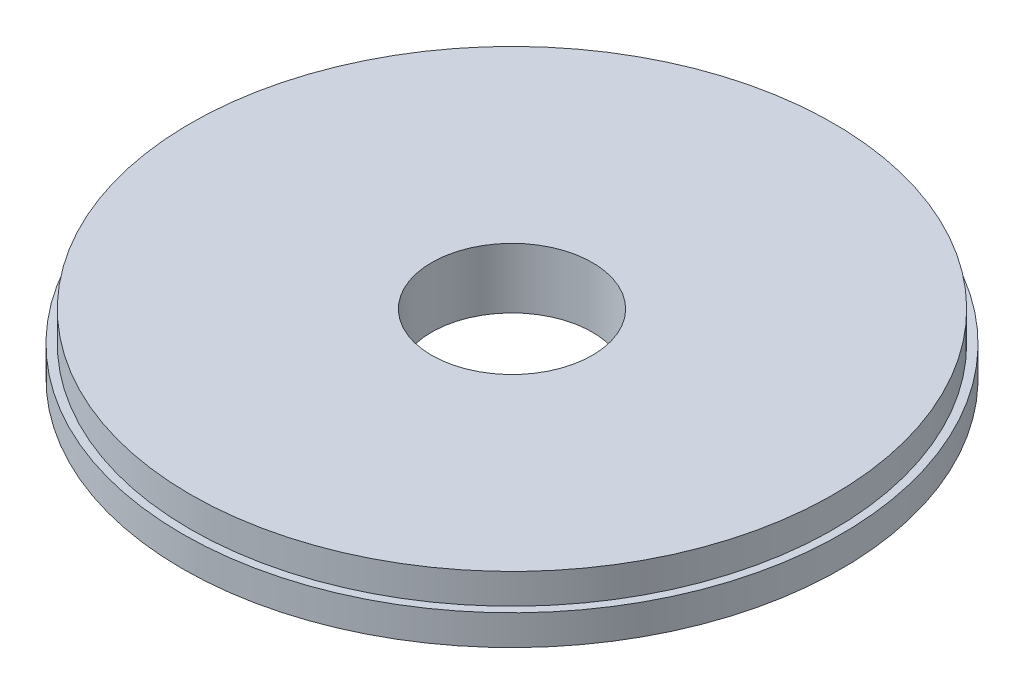
ISO-10303-21;
HEADER;
FILE_DESCRIPTION(('STEP AP214'),'2;1');
FILE_NAME('part.step','',(''),(''),'','','');
FILE_SCHEMA(('AUTOMOTIVE_DESIGN { 1 0 10303 214 1 1 1 1 }'));
ENDSEC;
DATA;
#1=APPLICATION_CONTEXT('core data for automotive mechanical design processes');
#2=APPLICATION_PROTOCOL_DEFINITION('international standard','automotive_design',2000,#1);
#3=PRODUCT_CONTEXT('',#1,'mechanical');
#4=PRODUCT('Part','Part','',(#3));
#5=PRODUCT_RELATED_PRODUCT_CATEGORY('part','',(#4));
#6=PRODUCT_DEFINITION_FORMATION('','',#4);
#7=PRODUCT_DEFINITION_CONTEXT('part definition',#1,'design');
#8=PRODUCT_DEFINITION('design','',#6,#7);
#9=PRODUCT_DEFINITION_SHAPE('','',#8);
#10=(LENGTH_UNIT() NAMED_UNIT(*) SI_UNIT(.MILLI.,.METRE.));
#11=(NAMED_UNIT(*) PLANE_ANGLE_UNIT() SI_UNIT($,.RADIAN.));
#12=(NAMED_UNIT(*) SI_UNIT($,.STERADIAN.) SOLID_ANGLE_UNIT());
#13=UNCERTAINTY_MEASURE_WITH_UNIT(LENGTH_MEASURE(1.E-05),#10,'distance_accuracy_value','');
#14=(GEOMETRIC_REPRESENTATION_CONTEXT(3) GLOBAL_UNCERTAINTY_ASSIGNED_CONTEXT((#13)) GLOBAL_UNIT_ASSIGNED_CONTEXT((#10,
#11,#12)) REPRESENTATION_CONTEXT('',''));
#15=CARTESIAN_POINT('',(0.,0.,0.));
#16=DIRECTION('',(0.,0.,1.));
#17=DIRECTION('',(1.,0.,0.));
#18=AXIS2_PLACEMENT_3D('',#15,#16,#17);
#19=CARTESIAN_POINT('',(0.,9.525,0.));
#20=DIRECTION('',(0.,1.,0.));
#21=DIRECTION('',(0.,0.,1.));
#22=AXIS2_PLACEMENT_3D('',#19,#20,#21);
#23=PLANE('',#22);
#24=CARTESIAN_POINT('',(0.,9.525,0.));
#25=DIRECTION('',(0.,1.,0.));
#26=DIRECTION('',(0.,0.,1.));
#27=AXIS2_PLACEMENT_3D('',#24,#25,#26);
#28=CIRCLE('',#27,101.6);
#29=CARTESIAN_POINT('',(0.,9.525,101.6));
#30=VERTEX_POINT('',#29);
#31=EDGE_CURVE('E10',#30,#30,#28,.T.);
#32=ORIENTED_EDGE('',*,*,#31,.T.);
#33=EDGE_LOOP('',(#32));
#34=FACE_BOUND('',#33,.T.);
#35=CARTESIAN_POINT('',(0.,9.525,0.));
#36=DIRECTION('',(0.,1.,0.));
#37=DIRECTION('',(0.,0.,1.));
#38=AXIS2_PLACEMENT_3D('',#35,#36,#37);
#39=CIRCLE('',#38,25.4);
#40=CARTESIAN_POINT('',(0.,9.525,25.4));
#41=VERTEX_POINT('',#40);
#42=EDGE_CURVE('E39',#41,#41,#39,.T.);
#43=ORIENTED_EDGE('',*,*,#42,.F.);
#44=EDGE_LOOP('',(#43));
#45=FACE_BOUND('',#44,.T.);
#46=ADVANCED_FACE('F32',(#34,#45),#23,.T.);
#47=CARTESIAN_POINT('',(0.,-9.525,0.));
#48=DIRECTION('',(0.,1.,0.));
#49=DIRECTION('',(0.,0.,1.));
#50=AXIS2_PLACEMENT_3D('',#47,#48,#49);
#51=PLANE('',#50);
#52=CARTESIAN_POINT('',(0.,-9.525,0.));
#53=DIRECTION('',(0.,1.,0.));
#54=DIRECTION('',(0.,0.,1.));
#55=AXIS2_PLACEMENT_3D('',#52,#53,#54);
#56=CIRCLE('',#55,25.4);
#57=CARTESIAN_POINT('',(0.,-9.525,25.4));
#58=VERTEX_POINT('',#57);
#59=EDGE_CURVE('E43',#58,#58,#56,.T.);
#60=ORIENTED_EDGE('',*,*,#59,.T.);
#61=EDGE_LOOP('',(#60));
#62=FACE_BOUND('',#61,.T.);
#63=CARTESIAN_POINT('',(0.,-9.525,0.));
#64=DIRECTION('',(0.,1.,0.));
#65=DIRECTION('',(0.,0.,1.));
#66=AXIS2_PLACEMENT_3D('',#63,#64,#65);
#67=CIRCLE('',#66,104.14);
#68=CARTESIAN_POINT('',(0.,-9.525,104.14));
#69=VERTEX_POINT('',#68);
#70=EDGE_CURVE('E53',#69,#69,#67,.T.);
#71=ORIENTED_EDGE('',*,*,#70,.F.);
#72=EDGE_LOOP('',(#71));
#73=FACE_BOUND('',#72,.T.);
#74=ADVANCED_FACE('F74',(#62,#73),#51,.F.);
#75=CARTESIAN_POINT('',(0.,9.525,0.));
#76=DIRECTION('',(0.,-1.,0.));
#77=DIRECTION('',(0.,0.,-1.));
#78=AXIS2_PLACEMENT_3D('',#75,#76,#77);
#79=CYLINDRICAL_SURFACE('',#78,101.6);
#80=CARTESIAN_POINT('',(0.,0.,0.));
#81=DIRECTION('',(0.,1.,0.));
#82=DIRECTION('',(0.,0.,1.));
#83=AXIS2_PLACEMENT_3D('',#80,#81,#82);
#84=CIRCLE('',#83,101.6);
#85=CARTESIAN_POINT('',(0.,0.,101.6));
#86=VERTEX_POINT('',#85);
#87=EDGE_CURVE('E50',#86,#86,#84,.T.);
#88=ORIENTED_EDGE('',*,*,#87,.T.);
#89=EDGE_LOOP('',(#88));
#90=FACE_BOUND('',#89,.T.);
#91=ORIENTED_EDGE('',*,*,#31,.F.);
#92=EDGE_LOOP('',(#91));
#93=FACE_BOUND('',#92,.T.);
#94=ADVANCED_FACE('F34',(#90,#93),#79,.T.);
#95=CARTESIAN_POINT('',(0.,9.525,0.));
#96=DIRECTION('',(0.,-1.,0.));
#97=DIRECTION('',(0.,0.,-1.));
#98=AXIS2_PLACEMENT_3D('',#95,#96,#97);
#99=CYLINDRICAL_SURFACE('',#98,25.4);
#100=ORIENTED_EDGE('',*,*,#42,.T.);
#101=EDGE_LOOP('',(#100));
#102=FACE_BOUND('',#101,.T.);
#103=ORIENTED_EDGE('',*,*,#59,.F.);
#104=EDGE_LOOP('',(#103));
#105=FACE_BOUND('',#104,.T.);
#106=ADVANCED_FACE('F63',(#102,#105),#99,.F.);
#107=CARTESIAN_POINT('',(0.,294.552400771068,0.));
#108=DIRECTION('',(0.,-1.,0.));
#109=DIRECTION('',(0.,0.,-1.));
#110=AXIS2_PLACEMENT_3D('',#107,#108,#109);
#111=CYLINDRICAL_SURFACE('',#110,104.14);
#112=ORIENTED_EDGE('',*,*,#70,.T.);
#113=EDGE_LOOP('',(#112));
#114=FACE_BOUND('',#113,.T.);
#115=CARTESIAN_POINT('',(0.,0.,0.));
#116=DIRECTION('',(0.,1.,0.));
#117=DIRECTION('',(0.,0.,1.));
#118=AXIS2_PLACEMENT_3D('',#115,#116,#117);
#119=CIRCLE('',#118,104.14);
#120=CARTESIAN_POINT('',(0.,0.,104.14));
#121=VERTEX_POINT('',#120);
#122=EDGE_CURVE('E48',#121,#121,#119,.T.);
#123=ORIENTED_EDGE('',*,*,#122,.F.);
#124=EDGE_LOOP('',(#123));
#125=FACE_BOUND('',#124,.T.);
#126=ADVANCED_FACE('F61',(#114,#125),#111,.T.);
#127=CARTESIAN_POINT('',(0.,0.,0.));
#128=DIRECTION('',(0.,1.,0.));
#129=DIRECTION('',(0.,0.,1.));
#130=AXIS2_PLACEMENT_3D('',#127,#128,#129);
#131=PLANE('',#130);
#132=ORIENTED_EDGE('',*,*,#87,.F.);
#133=EDGE_LOOP('',(#132));
#134=FACE_BOUND('',#133,.T.);
#135=ORIENTED_EDGE('',*,*,#122,.T.);
#136=EDGE_LOOP('',(#135));
#137=FACE_BOUND('',#136,.T.);
#138=ADVANCED_FACE('F59',(#134,#137),#131,.T.);
#139=CLOSED_SHELL('',(#46,#74,#94,#106,#126,#138));
#140=MANIFOLD_SOLID_BREP('B2',#139);
#141=ADVANCED_BREP_SHAPE_REPRESENTATION('',(#18,#140),#14);
#142=SHAPE_DEFINITION_REPRESENTATION(#9,#141);
ENDSEC;
END-ISO-10303-21;
